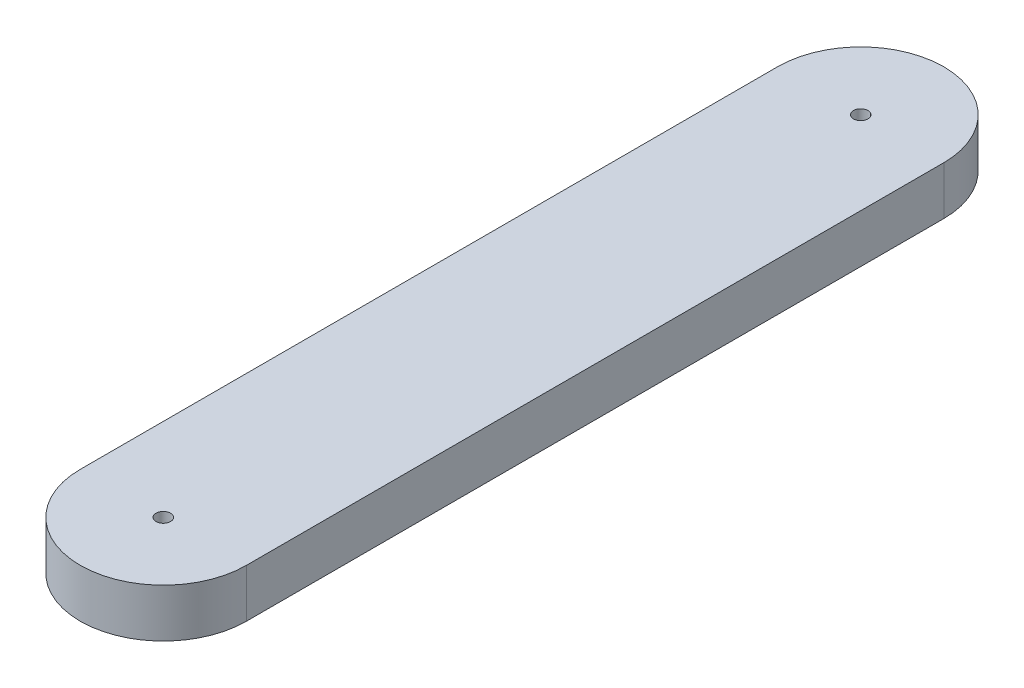
ISO-10303-21;
HEADER;
FILE_DESCRIPTION(('STEP AP214'),'2;1');
FILE_NAME('part.step','',(''),(''),'','','');
FILE_SCHEMA(('AUTOMOTIVE_DESIGN { 1 0 10303 214 1 1 1 1 }'));
ENDSEC;
DATA;
#1=APPLICATION_CONTEXT('core data for automotive mechanical design processes');
#2=APPLICATION_PROTOCOL_DEFINITION('international standard','automotive_design',2000,#1);
#3=PRODUCT_CONTEXT('',#1,'mechanical');
#4=PRODUCT('Part','Part','',(#3));
#5=PRODUCT_RELATED_PRODUCT_CATEGORY('part','',(#4));
#6=PRODUCT_DEFINITION_FORMATION('','',#4);
#7=PRODUCT_DEFINITION_CONTEXT('part definition',#1,'design');
#8=PRODUCT_DEFINITION('design','',#6,#7);
#9=PRODUCT_DEFINITION_SHAPE('','',#8);
#10=(LENGTH_UNIT() NAMED_UNIT(*) SI_UNIT(.MILLI.,.METRE.));
#11=(NAMED_UNIT(*) PLANE_ANGLE_UNIT() SI_UNIT($,.RADIAN.));
#12=(NAMED_UNIT(*) SI_UNIT($,.STERADIAN.) SOLID_ANGLE_UNIT());
#13=UNCERTAINTY_MEASURE_WITH_UNIT(LENGTH_MEASURE(1.E-05),#10,'distance_accuracy_value','');
#14=(GEOMETRIC_REPRESENTATION_CONTEXT(3) GLOBAL_UNCERTAINTY_ASSIGNED_CONTEXT((#13)) GLOBAL_UNIT_ASSIGNED_CONTEXT((#10,
#11,#12)) REPRESENTATION_CONTEXT('',''));
#15=CARTESIAN_POINT('',(0.,0.,0.));
#16=DIRECTION('',(0.,0.,1.));
#17=DIRECTION('',(1.,0.,0.));
#18=AXIS2_PLACEMENT_3D('',#15,#16,#17);
#19=CARTESIAN_POINT('',(-36.,5.,-36.));
#20=DIRECTION('',(0.,-1.,0.));
#21=DIRECTION('',(0.,0.,-1.));
#22=AXIS2_PLACEMENT_3D('',#19,#20,#21);
#23=CYLINDRICAL_SURFACE('',#22,8.58);
#24=CARTESIAN_POINT('',(-36.,0.,-36.));
#25=DIRECTION('',(0.,1.,0.));
#26=DIRECTION('',(0.,0.,1.));
#27=AXIS2_PLACEMENT_3D('',#24,#25,#26);
#28=CIRCLE('',#27,8.58);
#29=CARTESIAN_POINT('',(-27.42,0.,-36.));
#30=VERTEX_POINT('',#29);
#31=CARTESIAN_POINT('',(-44.58,0.,-36.));
#32=VERTEX_POINT('',#31);
#33=EDGE_CURVE('E97',#30,#32,#28,.T.);
#34=ORIENTED_EDGE('',*,*,#33,.T.);
#35=DIRECTION('',(0.,-1.,0.));
#36=VECTOR('',#35,1.);
#37=CARTESIAN_POINT('',(-44.58,5.,-36.));
#38=LINE('',#37,#36);
#39=CARTESIAN_POINT('',(-44.58,5.,-36.));
#40=VERTEX_POINT('',#39);
#41=EDGE_CURVE('E11',#40,#32,#38,.T.);
#42=ORIENTED_EDGE('',*,*,#41,.F.);
#43=CARTESIAN_POINT('',(-36.,5.,-36.));
#44=DIRECTION('',(0.,1.,0.));
#45=DIRECTION('',(0.,0.,1.));
#46=AXIS2_PLACEMENT_3D('',#43,#44,#45);
#47=CIRCLE('',#46,8.58);
#48=CARTESIAN_POINT('',(-27.42,5.,-36.));
#49=VERTEX_POINT('',#48);
#50=EDGE_CURVE('E83',#49,#40,#47,.T.);
#51=ORIENTED_EDGE('',*,*,#50,.F.);
#52=DIRECTION('',(0.,-1.,0.));
#53=VECTOR('',#52,1.);
#54=CARTESIAN_POINT('',(-27.42,5.,-36.));
#55=LINE('',#54,#53);
#56=EDGE_CURVE('E93',#49,#30,#55,.T.);
#57=ORIENTED_EDGE('',*,*,#56,.T.);
#58=EDGE_LOOP('',(#34,#42,#51,#57));
#59=FACE_BOUND('',#58,.T.);
#60=ADVANCED_FACE('F33',(#59),#23,.T.);
#61=CARTESIAN_POINT('',(-44.58,5.,8.58201971431247));
#62=DIRECTION('',(1.,0.,0.));
#63=DIRECTION('',(0.,0.,-1.));
#64=AXIS2_PLACEMENT_3D('',#61,#62,#63);
#65=PLANE('',#64);
#66=DIRECTION('',(0.,0.,1.));
#67=VECTOR('',#66,1.);
#68=CARTESIAN_POINT('',(-44.58,0.,8.58201971431247));
#69=LINE('',#68,#67);
#70=CARTESIAN_POINT('',(-44.58,0.,36.));
#71=VERTEX_POINT('',#70);
#72=EDGE_CURVE('E88',#32,#71,#69,.T.);
#73=ORIENTED_EDGE('',*,*,#72,.T.);
#74=DIRECTION('',(0.,-1.,0.));
#75=VECTOR('',#74,1.);
#76=CARTESIAN_POINT('',(-44.58,5.,36.));
#77=LINE('',#76,#75);
#78=CARTESIAN_POINT('',(-44.58,5.,36.));
#79=VERTEX_POINT('',#78);
#80=EDGE_CURVE('E41',#79,#71,#77,.T.);
#81=ORIENTED_EDGE('',*,*,#80,.F.);
#82=DIRECTION('',(0.,0.,1.));
#83=VECTOR('',#82,1.);
#84=CARTESIAN_POINT('',(-44.58,5.,-36.));
#85=LINE('',#84,#83);
#86=EDGE_CURVE('E77',#40,#79,#85,.T.);
#87=ORIENTED_EDGE('',*,*,#86,.F.);
#88=ORIENTED_EDGE('',*,*,#41,.T.);
#89=EDGE_LOOP('',(#73,#81,#87,#88));
#90=FACE_BOUND('',#89,.T.);
#91=ADVANCED_FACE('F87',(#90),#65,.F.);
#92=CARTESIAN_POINT('',(-36.,5.,36.));
#93=DIRECTION('',(0.,-1.,0.));
#94=DIRECTION('',(0.,0.,-1.));
#95=AXIS2_PLACEMENT_3D('',#92,#93,#94);
#96=CYLINDRICAL_SURFACE('',#95,8.58);
#97=CARTESIAN_POINT('',(-36.,0.,36.));
#98=DIRECTION('',(0.,1.,0.));
#99=DIRECTION('',(0.,0.,1.));
#100=AXIS2_PLACEMENT_3D('',#97,#98,#99);
#101=CIRCLE('',#100,8.58);
#102=CARTESIAN_POINT('',(-27.42,0.,36.));
#103=VERTEX_POINT('',#102);
#104=EDGE_CURVE('E102',#71,#103,#101,.T.);
#105=ORIENTED_EDGE('',*,*,#104,.T.);
#106=DIRECTION('',(0.,-1.,0.));
#107=VECTOR('',#106,1.);
#108=CARTESIAN_POINT('',(-27.42,5.,36.));
#109=LINE('',#108,#107);
#110=CARTESIAN_POINT('',(-27.42,5.,36.));
#111=VERTEX_POINT('',#110);
#112=EDGE_CURVE('E90',#111,#103,#109,.T.);
#113=ORIENTED_EDGE('',*,*,#112,.F.);
#114=CARTESIAN_POINT('',(-36.,5.,36.));
#115=DIRECTION('',(0.,1.,0.));
#116=DIRECTION('',(0.,0.,1.));
#117=AXIS2_PLACEMENT_3D('',#114,#115,#116);
#118=CIRCLE('',#117,8.58);
#119=EDGE_CURVE('E80',#79,#111,#118,.T.);
#120=ORIENTED_EDGE('',*,*,#119,.F.);
#121=ORIENTED_EDGE('',*,*,#80,.T.);
#122=EDGE_LOOP('',(#105,#113,#120,#121));
#123=FACE_BOUND('',#122,.T.);
#124=ADVANCED_FACE('F91',(#123),#96,.T.);
#125=CARTESIAN_POINT('',(-27.42,5.,-36.));
#126=DIRECTION('',(-1.,0.,0.));
#127=DIRECTION('',(0.,0.,1.));
#128=AXIS2_PLACEMENT_3D('',#125,#126,#127);
#129=PLANE('',#128);
#130=DIRECTION('',(0.,0.,-1.));
#131=VECTOR('',#130,1.);
#132=CARTESIAN_POINT('',(-27.42,0.,-36.));
#133=LINE('',#132,#131);
#134=EDGE_CURVE('E66',#103,#30,#133,.T.);
#135=ORIENTED_EDGE('',*,*,#134,.T.);
#136=ORIENTED_EDGE('',*,*,#56,.F.);
#137=DIRECTION('',(0.,0.,-1.));
#138=VECTOR('',#137,1.);
#139=CARTESIAN_POINT('',(-27.42,5.,8.58201971431247));
#140=LINE('',#139,#138);
#141=EDGE_CURVE('E49',#111,#49,#140,.T.);
#142=ORIENTED_EDGE('',*,*,#141,.F.);
#143=ORIENTED_EDGE('',*,*,#112,.T.);
#144=EDGE_LOOP('',(#135,#136,#142,#143));
#145=FACE_BOUND('',#144,.T.);
#146=ADVANCED_FACE('F106',(#145),#129,.F.);
#147=CARTESIAN_POINT('',(-36.,5.,-36.));
#148=DIRECTION('',(0.,1.,0.));
#149=DIRECTION('',(0.,0.,1.));
#150=AXIS2_PLACEMENT_3D('',#147,#148,#149);
#151=PLANE('',#150);
#152=CARTESIAN_POINT('',(-36.,5.,-36.));
#153=DIRECTION('',(0.,1.,0.));
#154=DIRECTION('',(0.,0.,1.));
#155=AXIS2_PLACEMENT_3D('',#152,#153,#154);
#156=CIRCLE('',#155,0.749999999999999);
#157=CARTESIAN_POINT('',(-36.,5.,-35.25));
#158=VERTEX_POINT('',#157);
#159=EDGE_CURVE('E121',#158,#158,#156,.T.);
#160=ORIENTED_EDGE('',*,*,#159,.F.);
#161=EDGE_LOOP('',(#160));
#162=FACE_BOUND('',#161,.T.);
#163=CARTESIAN_POINT('',(-36.,5.,36.));
#164=DIRECTION('',(0.,1.,0.));
#165=DIRECTION('',(0.,0.,-1.));
#166=AXIS2_PLACEMENT_3D('',#163,#164,#165);
#167=CIRCLE('',#166,0.749999999999999);
#168=CARTESIAN_POINT('',(-36.,5.,35.25));
#169=VERTEX_POINT('',#168);
#170=EDGE_CURVE('E115',#169,#169,#167,.T.);
#171=ORIENTED_EDGE('',*,*,#170,.F.);
#172=EDGE_LOOP('',(#171));
#173=FACE_BOUND('',#172,.T.);
#174=ORIENTED_EDGE('',*,*,#50,.T.);
#175=ORIENTED_EDGE('',*,*,#86,.T.);
#176=ORIENTED_EDGE('',*,*,#119,.T.);
#177=ORIENTED_EDGE('',*,*,#141,.T.);
#178=EDGE_LOOP('',(#174,#175,#176,#177));
#179=FACE_BOUND('',#178,.T.);
#180=ADVANCED_FACE('F78',(#162,#173,#179),#151,.T.);
#181=CARTESIAN_POINT('',(-36.,0.,-36.));
#182=DIRECTION('',(0.,1.,0.));
#183=DIRECTION('',(0.,0.,1.));
#184=AXIS2_PLACEMENT_3D('',#181,#182,#183);
#185=PLANE('',#184);
#186=CARTESIAN_POINT('',(-36.,0.,0.));
#187=DIRECTION('',(0.,-1.,0.));
#188=DIRECTION('',(0.,0.,-1.));
#189=AXIS2_PLACEMENT_3D('',#186,#187,#188);
#190=CIRCLE('',#189,0.749999999999999);
#191=CARTESIAN_POINT('',(-36.,0.,-0.749999999999999));
#192=VERTEX_POINT('',#191);
#193=EDGE_CURVE('E109',#192,#192,#190,.T.);
#194=ORIENTED_EDGE('',*,*,#193,.F.);
#195=EDGE_LOOP('',(#194));
#196=FACE_BOUND('',#195,.T.);
#197=ORIENTED_EDGE('',*,*,#33,.F.);
#198=ORIENTED_EDGE('',*,*,#134,.F.);
#199=ORIENTED_EDGE('',*,*,#104,.F.);
#200=ORIENTED_EDGE('',*,*,#72,.F.);
#201=EDGE_LOOP('',(#197,#198,#199,#200));
#202=FACE_BOUND('',#201,.T.);
#203=ADVANCED_FACE('F138',(#196,#202),#185,.F.);
#204=CARTESIAN_POINT('',(-36.,3.,0.));
#205=DIRECTION('',(0.,-1.,0.));
#206=DIRECTION('',(0.,0.,-1.));
#207=AXIS2_PLACEMENT_3D('',#204,#205,#206);
#208=CYLINDRICAL_SURFACE('',#207,0.749999999999999);
#209=CARTESIAN_POINT('',(-36.,3.,0.));
#210=DIRECTION('',(0.,-1.,0.));
#211=DIRECTION('',(0.,0.,-1.));
#212=AXIS2_PLACEMENT_3D('',#209,#210,#211);
#213=CIRCLE('',#212,0.749999999999999);
#214=CARTESIAN_POINT('',(-36.,3.,-0.749999999999999));
#215=VERTEX_POINT('',#214);
#216=EDGE_CURVE('E100',#215,#215,#213,.T.);
#217=ORIENTED_EDGE('',*,*,#216,.F.);
#218=EDGE_LOOP('',(#217));
#219=FACE_BOUND('',#218,.T.);
#220=ORIENTED_EDGE('',*,*,#193,.T.);
#221=EDGE_LOOP('',(#220));
#222=FACE_BOUND('',#221,.T.);
#223=ADVANCED_FACE('F153',(#219,#222),#208,.F.);
#224=CARTESIAN_POINT('',(-36.,3.,0.));
#225=DIRECTION('',(0.,-1.,0.));
#226=DIRECTION('',(0.,0.,-1.));
#227=AXIS2_PLACEMENT_3D('',#224,#225,#226);
#228=PLANE('',#227);
#229=ORIENTED_EDGE('',*,*,#216,.T.);
#230=EDGE_LOOP('',(#229));
#231=FACE_BOUND('',#230,.T.);
#232=ADVANCED_FACE('F144',(#231),#228,.T.);
#233=CARTESIAN_POINT('',(-36.,2.,36.));
#234=DIRECTION('',(0.,1.,0.));
#235=DIRECTION('',(0.,0.,1.));
#236=AXIS2_PLACEMENT_3D('',#233,#234,#235);
#237=CYLINDRICAL_SURFACE('',#236,0.749999999999999);
#238=CARTESIAN_POINT('',(-36.,2.,36.));
#239=DIRECTION('',(0.,1.,0.));
#240=DIRECTION('',(0.,0.,-1.));
#241=AXIS2_PLACEMENT_3D('',#238,#239,#240);
#242=CIRCLE('',#241,0.749999999999999);
#243=CARTESIAN_POINT('',(-36.,2.,35.25));
#244=VERTEX_POINT('',#243);
#245=EDGE_CURVE('E118',#244,#244,#242,.T.);
#246=ORIENTED_EDGE('',*,*,#245,.F.);
#247=EDGE_LOOP('',(#246));
#248=FACE_BOUND('',#247,.T.);
#249=ORIENTED_EDGE('',*,*,#170,.T.);
#250=EDGE_LOOP('',(#249));
#251=FACE_BOUND('',#250,.T.);
#252=ADVANCED_FACE('F142',(#248,#251),#237,.F.);
#253=CARTESIAN_POINT('',(-36.,2.,36.));
#254=DIRECTION('',(0.,-1.,0.));
#255=DIRECTION('',(0.,0.,-1.));
#256=AXIS2_PLACEMENT_3D('',#253,#254,#255);
#257=PLANE('',#256);
#258=ORIENTED_EDGE('',*,*,#245,.T.);
#259=EDGE_LOOP('',(#258));
#260=FACE_BOUND('',#259,.T.);
#261=ADVANCED_FACE('F132',(#260),#257,.F.);
#262=CARTESIAN_POINT('',(-36.,2.,-36.));
#263=DIRECTION('',(0.,1.,0.));
#264=DIRECTION('',(0.,0.,1.));
#265=AXIS2_PLACEMENT_3D('',#262,#263,#264);
#266=CYLINDRICAL_SURFACE('',#265,0.749999999999999);
#267=CARTESIAN_POINT('',(-36.,2.,-36.));
#268=DIRECTION('',(0.,1.,0.));
#269=DIRECTION('',(0.,0.,1.));
#270=AXIS2_PLACEMENT_3D('',#267,#268,#269);
#271=CIRCLE('',#270,0.749999999999999);
#272=CARTESIAN_POINT('',(-36.,2.,-35.25));
#273=VERTEX_POINT('',#272);
#274=EDGE_CURVE('E112',#273,#273,#271,.T.);
#275=ORIENTED_EDGE('',*,*,#274,.F.);
#276=EDGE_LOOP('',(#275));
#277=FACE_BOUND('',#276,.T.);
#278=ORIENTED_EDGE('',*,*,#159,.T.);
#279=EDGE_LOOP('',(#278));
#280=FACE_BOUND('',#279,.T.);
#281=ADVANCED_FACE('F129',(#277,#280),#266,.F.);
#282=CARTESIAN_POINT('',(-36.,2.,-36.));
#283=DIRECTION('',(0.,1.,0.));
#284=DIRECTION('',(0.,0.,1.));
#285=AXIS2_PLACEMENT_3D('',#282,#283,#284);
#286=PLANE('',#285);
#287=ORIENTED_EDGE('',*,*,#274,.T.);
#288=EDGE_LOOP('',(#287));
#289=FACE_BOUND('',#288,.T.);
#290=ADVANCED_FACE('F127',(#289),#286,.T.);
#291=CLOSED_SHELL('',(#60,#91,#124,#146,#180,#203,#223,#232,#252,#261,#281,#290));
#292=MANIFOLD_SOLID_BREP('B2',#291);
#293=ADVANCED_BREP_SHAPE_REPRESENTATION('',(#18,#292),#14);
#294=SHAPE_DEFINITION_REPRESENTATION(#9,#293);
ENDSEC;
END-ISO-10303-21;
